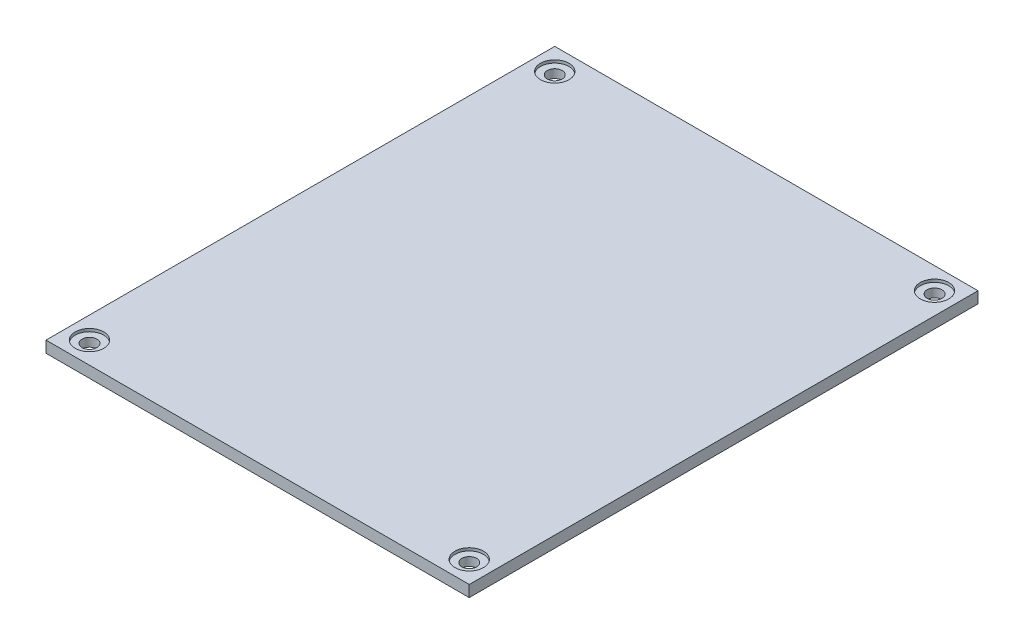
ISO-10303-21;
HEADER;
FILE_DESCRIPTION(('STEP AP214'),'2;1');
FILE_NAME('part.step','',(''),(''),'','','');
FILE_SCHEMA(('AUTOMOTIVE_DESIGN { 1 0 10303 214 1 1 1 1 }'));
ENDSEC;
DATA;
#1=APPLICATION_CONTEXT('core data for automotive mechanical design processes');
#2=APPLICATION_PROTOCOL_DEFINITION('international standard','automotive_design',2000,#1);
#3=PRODUCT_CONTEXT('',#1,'mechanical');
#4=PRODUCT('Part','Part','',(#3));
#5=PRODUCT_RELATED_PRODUCT_CATEGORY('part','',(#4));
#6=PRODUCT_DEFINITION_FORMATION('','',#4);
#7=PRODUCT_DEFINITION_CONTEXT('part definition',#1,'design');
#8=PRODUCT_DEFINITION('design','',#6,#7);
#9=PRODUCT_DEFINITION_SHAPE('','',#8);
#10=(LENGTH_UNIT() NAMED_UNIT(*) SI_UNIT(.MILLI.,.METRE.));
#11=(NAMED_UNIT(*) PLANE_ANGLE_UNIT() SI_UNIT($,.RADIAN.));
#12=(NAMED_UNIT(*) SI_UNIT($,.STERADIAN.) SOLID_ANGLE_UNIT());
#13=UNCERTAINTY_MEASURE_WITH_UNIT(LENGTH_MEASURE(1.E-05),#10,'distance_accuracy_value','');
#14=(GEOMETRIC_REPRESENTATION_CONTEXT(3) GLOBAL_UNCERTAINTY_ASSIGNED_CONTEXT((#13)) GLOBAL_UNIT_ASSIGNED_CONTEXT((#10,
#11,#12)) REPRESENTATION_CONTEXT('',''));
#15=CARTESIAN_POINT('',(0.,0.,0.));
#16=DIRECTION('',(0.,0.,1.));
#17=DIRECTION('',(1.,0.,0.));
#18=AXIS2_PLACEMENT_3D('',#15,#16,#17);
#19=CARTESIAN_POINT('',(37.084,2.,0.));
#20=DIRECTION('',(1.,0.,0.));
#21=DIRECTION('',(0.,0.,-1.));
#22=AXIS2_PLACEMENT_3D('',#19,#20,#21);
#23=PLANE('',#22);
#24=DIRECTION('',(0.,0.,1.));
#25=VECTOR('',#24,1.);
#26=CARTESIAN_POINT('',(37.084,0.,0.));
#27=LINE('',#26,#25);
#28=CARTESIAN_POINT('',(37.084,0.,-44.577));
#29=VERTEX_POINT('',#28);
#30=CARTESIAN_POINT('',(37.084,0.,44.577));
#31=VERTEX_POINT('',#30);
#32=EDGE_CURVE('E117',#29,#31,#27,.T.);
#33=ORIENTED_EDGE('',*,*,#32,.F.);
#34=DIRECTION('',(0.,-1.,0.));
#35=VECTOR('',#34,1.);
#36=CARTESIAN_POINT('',(37.084,2.,-44.577));
#37=LINE('',#36,#35);
#38=CARTESIAN_POINT('',(37.084,2.,-44.577));
#39=VERTEX_POINT('',#38);
#40=EDGE_CURVE('E84',#39,#29,#37,.T.);
#41=ORIENTED_EDGE('',*,*,#40,.F.);
#42=DIRECTION('',(0.,0.,1.));
#43=VECTOR('',#42,1.);
#44=CARTESIAN_POINT('',(37.084,2.,0.));
#45=LINE('',#44,#43);
#46=CARTESIAN_POINT('',(37.084,2.,44.577));
#47=VERTEX_POINT('',#46);
#48=EDGE_CURVE('E107',#39,#47,#45,.T.);
#49=ORIENTED_EDGE('',*,*,#48,.T.);
#50=DIRECTION('',(0.,-1.,0.));
#51=VECTOR('',#50,1.);
#52=CARTESIAN_POINT('',(37.084,2.,44.577));
#53=LINE('',#52,#51);
#54=EDGE_CURVE('E81',#47,#31,#53,.T.);
#55=ORIENTED_EDGE('',*,*,#54,.T.);
#56=EDGE_LOOP('',(#33,#41,#49,#55));
#57=FACE_BOUND('',#56,.T.);
#58=ADVANCED_FACE('F39',(#57),#23,.T.);
#59=CARTESIAN_POINT('',(0.,2.,-44.577));
#60=DIRECTION('',(0.,0.,-1.));
#61=DIRECTION('',(-1.,0.,0.));
#62=AXIS2_PLACEMENT_3D('',#59,#60,#61);
#63=PLANE('',#62);
#64=DIRECTION('',(1.,0.,0.));
#65=VECTOR('',#64,1.);
#66=CARTESIAN_POINT('',(0.,0.,-44.577));
#67=LINE('',#66,#65);
#68=CARTESIAN_POINT('',(-37.084,0.,-44.577));
#69=VERTEX_POINT('',#68);
#70=EDGE_CURVE('E95',#69,#29,#67,.T.);
#71=ORIENTED_EDGE('',*,*,#70,.F.);
#72=DIRECTION('',(0.,-1.,0.));
#73=VECTOR('',#72,1.);
#74=CARTESIAN_POINT('',(-37.084,2.,-44.577));
#75=LINE('',#74,#73);
#76=CARTESIAN_POINT('',(-37.084,2.,-44.577));
#77=VERTEX_POINT('',#76);
#78=EDGE_CURVE('E89',#77,#69,#75,.T.);
#79=ORIENTED_EDGE('',*,*,#78,.F.);
#80=DIRECTION('',(1.,0.,0.));
#81=VECTOR('',#80,1.);
#82=CARTESIAN_POINT('',(0.,2.,-44.577));
#83=LINE('',#82,#81);
#84=EDGE_CURVE('E93',#77,#39,#83,.T.);
#85=ORIENTED_EDGE('',*,*,#84,.T.);
#86=ORIENTED_EDGE('',*,*,#40,.T.);
#87=EDGE_LOOP('',(#71,#79,#85,#86));
#88=FACE_BOUND('',#87,.T.);
#89=ADVANCED_FACE('F91',(#88),#63,.T.);
#90=CARTESIAN_POINT('',(-37.084,2.,0.));
#91=DIRECTION('',(1.,0.,0.));
#92=DIRECTION('',(0.,0.,-1.));
#93=AXIS2_PLACEMENT_3D('',#90,#91,#92);
#94=PLANE('',#93);
#95=DIRECTION('',(0.,0.,1.));
#96=VECTOR('',#95,1.);
#97=CARTESIAN_POINT('',(-37.084,0.,0.));
#98=LINE('',#97,#96);
#99=CARTESIAN_POINT('',(-37.084,0.,44.577));
#100=VERTEX_POINT('',#99);
#101=EDGE_CURVE('E123',#69,#100,#98,.T.);
#102=ORIENTED_EDGE('',*,*,#101,.T.);
#103=DIRECTION('',(0.,-1.,0.));
#104=VECTOR('',#103,1.);
#105=CARTESIAN_POINT('',(-37.084,2.,44.577));
#106=LINE('',#105,#104);
#107=CARTESIAN_POINT('',(-37.084,2.,44.577));
#108=VERTEX_POINT('',#107);
#109=EDGE_CURVE('E99',#108,#100,#106,.T.);
#110=ORIENTED_EDGE('',*,*,#109,.F.);
#111=DIRECTION('',(0.,0.,1.));
#112=VECTOR('',#111,1.);
#113=CARTESIAN_POINT('',(-37.084,2.,0.));
#114=LINE('',#113,#112);
#115=EDGE_CURVE('E102',#77,#108,#114,.T.);
#116=ORIENTED_EDGE('',*,*,#115,.F.);
#117=ORIENTED_EDGE('',*,*,#78,.T.);
#118=EDGE_LOOP('',(#102,#110,#116,#117));
#119=FACE_BOUND('',#118,.T.);
#120=ADVANCED_FACE('F103',(#119),#94,.F.);
#121=CARTESIAN_POINT('',(-33.274,2.,-40.767));
#122=DIRECTION('',(0.,-1.,0.));
#123=DIRECTION('',(0.,0.,-1.));
#124=AXIS2_PLACEMENT_3D('',#121,#122,#123);
#125=CYLINDRICAL_SURFACE('',#124,2.5);
#126=CARTESIAN_POINT('',(-33.274,1.5,-40.767));
#127=DIRECTION('',(0.,1.,0.));
#128=DIRECTION('',(0.,0.,1.));
#129=AXIS2_PLACEMENT_3D('',#126,#127,#128);
#130=CIRCLE('',#129,2.5);
#131=CARTESIAN_POINT('',(-33.274,1.5,-38.267));
#132=VERTEX_POINT('',#131);
#133=EDGE_CURVE('E135',#132,#132,#130,.T.);
#134=ORIENTED_EDGE('',*,*,#133,.F.);
#135=EDGE_LOOP('',(#134));
#136=FACE_BOUND('',#135,.T.);
#137=CARTESIAN_POINT('',(-33.274,2.,-40.767));
#138=DIRECTION('',(0.,1.,0.));
#139=DIRECTION('',(0.,0.,1.));
#140=AXIS2_PLACEMENT_3D('',#137,#138,#139);
#141=CIRCLE('',#140,2.5);
#142=CARTESIAN_POINT('',(-33.274,2.,-38.267));
#143=VERTEX_POINT('',#142);
#144=EDGE_CURVE('E111',#143,#143,#141,.T.);
#145=ORIENTED_EDGE('',*,*,#144,.T.);
#146=EDGE_LOOP('',(#145));
#147=FACE_BOUND('',#146,.T.);
#148=ADVANCED_FACE('F172',(#136,#147),#125,.F.);
#149=CARTESIAN_POINT('',(33.274,2.,-40.767));
#150=DIRECTION('',(0.,-1.,0.));
#151=DIRECTION('',(0.,0.,-1.));
#152=AXIS2_PLACEMENT_3D('',#149,#150,#151);
#153=CYLINDRICAL_SURFACE('',#152,2.5);
#154=CARTESIAN_POINT('',(33.274,1.5,-40.767));
#155=DIRECTION('',(0.,1.,0.));
#156=DIRECTION('',(0.,0.,1.));
#157=AXIS2_PLACEMENT_3D('',#154,#155,#156);
#158=CIRCLE('',#157,2.5);
#159=CARTESIAN_POINT('',(33.274,1.5,-38.267));
#160=VERTEX_POINT('',#159);
#161=EDGE_CURVE('E139',#160,#160,#158,.T.);
#162=ORIENTED_EDGE('',*,*,#161,.F.);
#163=EDGE_LOOP('',(#162));
#164=FACE_BOUND('',#163,.T.);
#165=CARTESIAN_POINT('',(33.274,2.,-40.767));
#166=DIRECTION('',(0.,1.,0.));
#167=DIRECTION('',(0.,0.,1.));
#168=AXIS2_PLACEMENT_3D('',#165,#166,#167);
#169=CIRCLE('',#168,2.5);
#170=CARTESIAN_POINT('',(33.274,2.,-38.267));
#171=VERTEX_POINT('',#170);
#172=EDGE_CURVE('E160',#171,#171,#169,.T.);
#173=ORIENTED_EDGE('',*,*,#172,.T.);
#174=EDGE_LOOP('',(#173));
#175=FACE_BOUND('',#174,.T.);
#176=ADVANCED_FACE('F197',(#164,#175),#153,.F.);
#177=CARTESIAN_POINT('',(33.274,2.,40.767));
#178=DIRECTION('',(0.,-1.,0.));
#179=DIRECTION('',(0.,0.,-1.));
#180=AXIS2_PLACEMENT_3D('',#177,#178,#179);
#181=CYLINDRICAL_SURFACE('',#180,2.5);
#182=CARTESIAN_POINT('',(33.274,1.5,40.767));
#183=DIRECTION('',(0.,1.,0.));
#184=DIRECTION('',(0.,0.,1.));
#185=AXIS2_PLACEMENT_3D('',#182,#183,#184);
#186=CIRCLE('',#185,2.5);
#187=CARTESIAN_POINT('',(33.274,1.5,43.267));
#188=VERTEX_POINT('',#187);
#189=EDGE_CURVE('E11',#188,#188,#186,.T.);
#190=ORIENTED_EDGE('',*,*,#189,.F.);
#191=EDGE_LOOP('',(#190));
#192=FACE_BOUND('',#191,.T.);
#193=CARTESIAN_POINT('',(33.274,2.,40.767));
#194=DIRECTION('',(0.,1.,0.));
#195=DIRECTION('',(0.,0.,1.));
#196=AXIS2_PLACEMENT_3D('',#193,#194,#195);
#197=CIRCLE('',#196,2.5);
#198=CARTESIAN_POINT('',(33.274,2.,43.267));
#199=VERTEX_POINT('',#198);
#200=EDGE_CURVE('E156',#199,#199,#197,.T.);
#201=ORIENTED_EDGE('',*,*,#200,.T.);
#202=EDGE_LOOP('',(#201));
#203=FACE_BOUND('',#202,.T.);
#204=ADVANCED_FACE('F151',(#192,#203),#181,.F.);
#205=CARTESIAN_POINT('',(-33.274,2.,40.767));
#206=DIRECTION('',(0.,-1.,0.));
#207=DIRECTION('',(0.,0.,-1.));
#208=AXIS2_PLACEMENT_3D('',#205,#206,#207);
#209=CYLINDRICAL_SURFACE('',#208,2.5);
#210=CARTESIAN_POINT('',(-33.274,1.5,40.767));
#211=DIRECTION('',(0.,1.,0.));
#212=DIRECTION('',(0.,0.,1.));
#213=AXIS2_PLACEMENT_3D('',#210,#211,#212);
#214=CIRCLE('',#213,2.5);
#215=CARTESIAN_POINT('',(-33.274,1.5,43.267));
#216=VERTEX_POINT('',#215);
#217=EDGE_CURVE('E49',#216,#216,#214,.T.);
#218=ORIENTED_EDGE('',*,*,#217,.F.);
#219=EDGE_LOOP('',(#218));
#220=FACE_BOUND('',#219,.T.);
#221=CARTESIAN_POINT('',(-33.274,2.,40.767));
#222=DIRECTION('',(0.,1.,0.));
#223=DIRECTION('',(0.,0.,1.));
#224=AXIS2_PLACEMENT_3D('',#221,#222,#223);
#225=CIRCLE('',#224,2.5);
#226=CARTESIAN_POINT('',(-33.274,2.,43.267));
#227=VERTEX_POINT('',#226);
#228=EDGE_CURVE('E128',#227,#227,#225,.T.);
#229=ORIENTED_EDGE('',*,*,#228,.T.);
#230=EDGE_LOOP('',(#229));
#231=FACE_BOUND('',#230,.T.);
#232=ADVANCED_FACE('F41',(#220,#231),#209,.F.);
#233=CARTESIAN_POINT('',(0.,2.,44.577));
#234=DIRECTION('',(0.,0.,-1.));
#235=DIRECTION('',(-1.,0.,0.));
#236=AXIS2_PLACEMENT_3D('',#233,#234,#235);
#237=PLANE('',#236);
#238=DIRECTION('',(1.,0.,0.));
#239=VECTOR('',#238,1.);
#240=CARTESIAN_POINT('',(0.,0.,44.577));
#241=LINE('',#240,#239);
#242=EDGE_CURVE('E74',#100,#31,#241,.T.);
#243=ORIENTED_EDGE('',*,*,#242,.T.);
#244=ORIENTED_EDGE('',*,*,#54,.F.);
#245=DIRECTION('',(1.,0.,0.));
#246=VECTOR('',#245,1.);
#247=CARTESIAN_POINT('',(0.,2.,44.577));
#248=LINE('',#247,#246);
#249=EDGE_CURVE('E57',#108,#47,#248,.T.);
#250=ORIENTED_EDGE('',*,*,#249,.F.);
#251=ORIENTED_EDGE('',*,*,#109,.T.);
#252=EDGE_LOOP('',(#243,#244,#250,#251));
#253=FACE_BOUND('',#252,.T.);
#254=ADVANCED_FACE('F150',(#253),#237,.F.);
#255=CARTESIAN_POINT('',(0.,2.,0.));
#256=DIRECTION('',(0.,1.,0.));
#257=DIRECTION('',(0.,0.,1.));
#258=AXIS2_PLACEMENT_3D('',#255,#256,#257);
#259=PLANE('',#258);
#260=ORIENTED_EDGE('',*,*,#228,.F.);
#261=EDGE_LOOP('',(#260));
#262=FACE_BOUND('',#261,.T.);
#263=ORIENTED_EDGE('',*,*,#200,.F.);
#264=EDGE_LOOP('',(#263));
#265=FACE_BOUND('',#264,.T.);
#266=ORIENTED_EDGE('',*,*,#172,.F.);
#267=EDGE_LOOP('',(#266));
#268=FACE_BOUND('',#267,.T.);
#269=ORIENTED_EDGE('',*,*,#144,.F.);
#270=EDGE_LOOP('',(#269));
#271=FACE_BOUND('',#270,.T.);
#272=ORIENTED_EDGE('',*,*,#48,.F.);
#273=ORIENTED_EDGE('',*,*,#84,.F.);
#274=ORIENTED_EDGE('',*,*,#115,.T.);
#275=ORIENTED_EDGE('',*,*,#249,.T.);
#276=EDGE_LOOP('',(#272,#273,#274,#275));
#277=FACE_BOUND('',#276,.T.);
#278=ADVANCED_FACE('F106',(#262,#265,#268,#271,#277),#259,.T.);
#279=CARTESIAN_POINT('',(0.,0.,0.));
#280=DIRECTION('',(0.,1.,0.));
#281=DIRECTION('',(0.,0.,1.));
#282=AXIS2_PLACEMENT_3D('',#279,#280,#281);
#283=PLANE('',#282);
#284=ORIENTED_EDGE('',*,*,#32,.T.);
#285=ORIENTED_EDGE('',*,*,#242,.F.);
#286=ORIENTED_EDGE('',*,*,#101,.F.);
#287=ORIENTED_EDGE('',*,*,#70,.T.);
#288=EDGE_LOOP('',(#284,#285,#286,#287));
#289=FACE_BOUND('',#288,.T.);
#290=CARTESIAN_POINT('',(-33.274,0.,-40.767));
#291=DIRECTION('',(0.,1.,0.));
#292=DIRECTION('',(0.,0.,1.));
#293=AXIS2_PLACEMENT_3D('',#290,#291,#292);
#294=CIRCLE('',#293,1.29999999999999);
#295=CARTESIAN_POINT('',(-33.274,0.,-39.467));
#296=VERTEX_POINT('',#295);
#297=EDGE_CURVE('E163',#296,#296,#294,.T.);
#298=ORIENTED_EDGE('',*,*,#297,.T.);
#299=EDGE_LOOP('',(#298));
#300=FACE_BOUND('',#299,.T.);
#301=CARTESIAN_POINT('',(33.274,0.,-40.767));
#302=DIRECTION('',(0.,1.,0.));
#303=DIRECTION('',(0.,0.,1.));
#304=AXIS2_PLACEMENT_3D('',#301,#302,#303);
#305=CIRCLE('',#304,1.3);
#306=CARTESIAN_POINT('',(33.274,0.,-39.467));
#307=VERTEX_POINT('',#306);
#308=EDGE_CURVE('E257',#307,#307,#305,.T.);
#309=ORIENTED_EDGE('',*,*,#308,.T.);
#310=EDGE_LOOP('',(#309));
#311=FACE_BOUND('',#310,.T.);
#312=CARTESIAN_POINT('',(-33.274,0.,40.767));
#313=DIRECTION('',(0.,1.,0.));
#314=DIRECTION('',(0.,0.,1.));
#315=AXIS2_PLACEMENT_3D('',#312,#313,#314);
#316=CIRCLE('',#315,1.29999999999999);
#317=CARTESIAN_POINT('',(-33.274,0.,42.067));
#318=VERTEX_POINT('',#317);
#319=EDGE_CURVE('E265',#318,#318,#316,.T.);
#320=ORIENTED_EDGE('',*,*,#319,.T.);
#321=EDGE_LOOP('',(#320));
#322=FACE_BOUND('',#321,.T.);
#323=CARTESIAN_POINT('',(33.274,0.,40.767));
#324=DIRECTION('',(0.,1.,0.));
#325=DIRECTION('',(0.,0.,1.));
#326=AXIS2_PLACEMENT_3D('',#323,#324,#325);
#327=CIRCLE('',#326,1.3);
#328=CARTESIAN_POINT('',(33.274,0.,42.067));
#329=VERTEX_POINT('',#328);
#330=EDGE_CURVE('E273',#329,#329,#327,.T.);
#331=ORIENTED_EDGE('',*,*,#330,.T.);
#332=EDGE_LOOP('',(#331));
#333=FACE_BOUND('',#332,.T.);
#334=ADVANCED_FACE('F175',(#289,#300,#311,#322,#333),#283,.F.);
#335=CARTESIAN_POINT('',(-33.274,1.5,-40.767));
#336=DIRECTION('',(0.,-1.,0.));
#337=DIRECTION('',(0.,0.,-1.));
#338=AXIS2_PLACEMENT_3D('',#335,#336,#337);
#339=CYLINDRICAL_SURFACE('',#338,1.29999999999999);
#340=CARTESIAN_POINT('',(-33.274,1.5,-40.767));
#341=DIRECTION('',(0.,1.,0.));
#342=DIRECTION('',(0.,0.,1.));
#343=AXIS2_PLACEMENT_3D('',#340,#341,#342);
#344=CIRCLE('',#343,1.29999999999999);
#345=CARTESIAN_POINT('',(-33.274,1.5,-39.467));
#346=VERTEX_POINT('',#345);
#347=EDGE_CURVE('E120',#346,#346,#344,.T.);
#348=ORIENTED_EDGE('',*,*,#347,.T.);
#349=EDGE_LOOP('',(#348));
#350=FACE_BOUND('',#349,.T.);
#351=ORIENTED_EDGE('',*,*,#297,.F.);
#352=EDGE_LOOP('',(#351));
#353=FACE_BOUND('',#352,.T.);
#354=ADVANCED_FACE('F181',(#350,#353),#339,.F.);
#355=CARTESIAN_POINT('',(0.,1.5,0.));
#356=DIRECTION('',(0.,1.,0.));
#357=DIRECTION('',(0.,0.,1.));
#358=AXIS2_PLACEMENT_3D('',#355,#356,#357);
#359=PLANE('',#358);
#360=ORIENTED_EDGE('',*,*,#347,.F.);
#361=EDGE_LOOP('',(#360));
#362=FACE_BOUND('',#361,.T.);
#363=ORIENTED_EDGE('',*,*,#133,.T.);
#364=EDGE_LOOP('',(#363));
#365=FACE_BOUND('',#364,.T.);
#366=ADVANCED_FACE('F238',(#362,#365),#359,.T.);
#367=CARTESIAN_POINT('',(33.274,1.5,-40.767));
#368=DIRECTION('',(0.,-1.,0.));
#369=DIRECTION('',(0.,0.,-1.));
#370=AXIS2_PLACEMENT_3D('',#367,#368,#369);
#371=CYLINDRICAL_SURFACE('',#370,1.3);
#372=CARTESIAN_POINT('',(33.274,1.5,-40.767));
#373=DIRECTION('',(0.,1.,0.));
#374=DIRECTION('',(0.,0.,1.));
#375=AXIS2_PLACEMENT_3D('',#372,#373,#374);
#376=CIRCLE('',#375,1.3);
#377=CARTESIAN_POINT('',(33.274,1.5,-39.467));
#378=VERTEX_POINT('',#377);
#379=EDGE_CURVE('E253',#378,#378,#376,.T.);
#380=ORIENTED_EDGE('',*,*,#379,.T.);
#381=EDGE_LOOP('',(#380));
#382=FACE_BOUND('',#381,.T.);
#383=ORIENTED_EDGE('',*,*,#308,.F.);
#384=EDGE_LOOP('',(#383));
#385=FACE_BOUND('',#384,.T.);
#386=ADVANCED_FACE('F234',(#382,#385),#371,.F.);
#387=CARTESIAN_POINT('',(0.,1.5,0.));
#388=DIRECTION('',(0.,1.,0.));
#389=DIRECTION('',(0.,0.,1.));
#390=AXIS2_PLACEMENT_3D('',#387,#388,#389);
#391=PLANE('',#390);
#392=ORIENTED_EDGE('',*,*,#379,.F.);
#393=EDGE_LOOP('',(#392));
#394=FACE_BOUND('',#393,.T.);
#395=ORIENTED_EDGE('',*,*,#161,.T.);
#396=EDGE_LOOP('',(#395));
#397=FACE_BOUND('',#396,.T.);
#398=ADVANCED_FACE('F230',(#394,#397),#391,.T.);
#399=CARTESIAN_POINT('',(-33.274,1.5,40.767));
#400=DIRECTION('',(0.,-1.,0.));
#401=DIRECTION('',(0.,0.,-1.));
#402=AXIS2_PLACEMENT_3D('',#399,#400,#401);
#403=CYLINDRICAL_SURFACE('',#402,1.29999999999999);
#404=CARTESIAN_POINT('',(-33.274,1.5,40.767));
#405=DIRECTION('',(0.,1.,0.));
#406=DIRECTION('',(0.,0.,1.));
#407=AXIS2_PLACEMENT_3D('',#404,#405,#406);
#408=CIRCLE('',#407,1.29999999999999);
#409=CARTESIAN_POINT('',(-33.274,1.5,42.067));
#410=VERTEX_POINT('',#409);
#411=EDGE_CURVE('E262',#410,#410,#408,.T.);
#412=ORIENTED_EDGE('',*,*,#411,.T.);
#413=EDGE_LOOP('',(#412));
#414=FACE_BOUND('',#413,.T.);
#415=ORIENTED_EDGE('',*,*,#319,.F.);
#416=EDGE_LOOP('',(#415));
#417=FACE_BOUND('',#416,.T.);
#418=ADVANCED_FACE('F226',(#414,#417),#403,.F.);
#419=CARTESIAN_POINT('',(0.,1.5,0.));
#420=DIRECTION('',(0.,1.,0.));
#421=DIRECTION('',(0.,0.,1.));
#422=AXIS2_PLACEMENT_3D('',#419,#420,#421);
#423=PLANE('',#422);
#424=ORIENTED_EDGE('',*,*,#411,.F.);
#425=EDGE_LOOP('',(#424));
#426=FACE_BOUND('',#425,.T.);
#427=ORIENTED_EDGE('',*,*,#217,.T.);
#428=EDGE_LOOP('',(#427));
#429=FACE_BOUND('',#428,.T.);
#430=ADVANCED_FACE('F146',(#426,#429),#423,.T.);
#431=CARTESIAN_POINT('',(33.274,1.5,40.767));
#432=DIRECTION('',(0.,-1.,0.));
#433=DIRECTION('',(0.,0.,-1.));
#434=AXIS2_PLACEMENT_3D('',#431,#432,#433);
#435=CYLINDRICAL_SURFACE('',#434,1.3);
#436=CARTESIAN_POINT('',(33.274,1.5,40.767));
#437=DIRECTION('',(0.,1.,0.));
#438=DIRECTION('',(0.,0.,1.));
#439=AXIS2_PLACEMENT_3D('',#436,#437,#438);
#440=CIRCLE('',#439,1.3);
#441=CARTESIAN_POINT('',(33.274,1.5,42.067));
#442=VERTEX_POINT('',#441);
#443=EDGE_CURVE('E269',#442,#442,#440,.T.);
#444=ORIENTED_EDGE('',*,*,#443,.T.);
#445=EDGE_LOOP('',(#444));
#446=FACE_BOUND('',#445,.T.);
#447=ORIENTED_EDGE('',*,*,#330,.F.);
#448=EDGE_LOOP('',(#447));
#449=FACE_BOUND('',#448,.T.);
#450=ADVANCED_FACE('F214',(#446,#449),#435,.F.);
#451=CARTESIAN_POINT('',(0.,1.5,0.));
#452=DIRECTION('',(0.,1.,0.));
#453=DIRECTION('',(0.,0.,1.));
#454=AXIS2_PLACEMENT_3D('',#451,#452,#453);
#455=PLANE('',#454);
#456=ORIENTED_EDGE('',*,*,#443,.F.);
#457=EDGE_LOOP('',(#456));
#458=FACE_BOUND('',#457,.T.);
#459=ORIENTED_EDGE('',*,*,#189,.T.);
#460=EDGE_LOOP('',(#459));
#461=FACE_BOUND('',#460,.T.);
#462=ADVANCED_FACE('F212',(#458,#461),#455,.T.);
#463=CLOSED_SHELL('',(#58,#89,#120,#148,#176,#204,#232,#254,#278,#334,#354,#366,#386,#398,#418,
#430,#450,#462));
#464=MANIFOLD_SOLID_BREP('B2',#463);
#465=ADVANCED_BREP_SHAPE_REPRESENTATION('',(#18,#464),#14);
#466=SHAPE_DEFINITION_REPRESENTATION(#9,#465);
ENDSEC;
END-ISO-10303-21;
